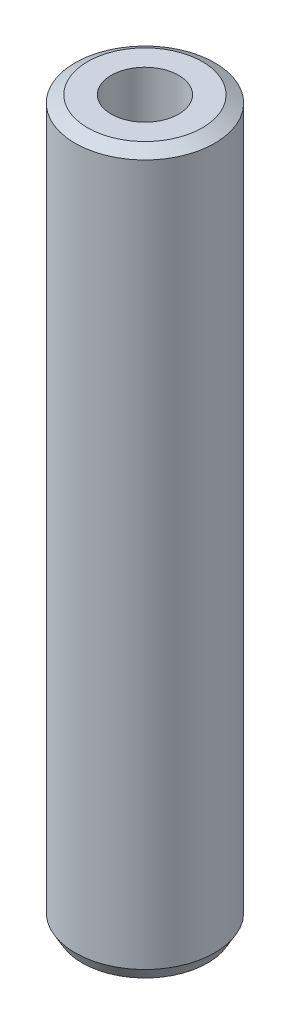
ISO-10303-21;
HEADER;
FILE_DESCRIPTION(('STEP AP214'),'2;1');
FILE_NAME('part.step','',(''),(''),'','','');
FILE_SCHEMA(('AUTOMOTIVE_DESIGN { 1 0 10303 214 1 1 1 1 }'));
ENDSEC;
DATA;
#1=APPLICATION_CONTEXT('core data for automotive mechanical design processes');
#2=APPLICATION_PROTOCOL_DEFINITION('international standard','automotive_design',2000,#1);
#3=PRODUCT_CONTEXT('',#1,'mechanical');
#4=PRODUCT('Part','Part','',(#3));
#5=PRODUCT_RELATED_PRODUCT_CATEGORY('part','',(#4));
#6=PRODUCT_DEFINITION_FORMATION('','',#4);
#7=PRODUCT_DEFINITION_CONTEXT('part definition',#1,'design');
#8=PRODUCT_DEFINITION('design','',#6,#7);
#9=PRODUCT_DEFINITION_SHAPE('','',#8);
#10=(LENGTH_UNIT() NAMED_UNIT(*) SI_UNIT(.MILLI.,.METRE.));
#11=(NAMED_UNIT(*) PLANE_ANGLE_UNIT() SI_UNIT($,.RADIAN.));
#12=(NAMED_UNIT(*) SI_UNIT($,.STERADIAN.) SOLID_ANGLE_UNIT());
#13=UNCERTAINTY_MEASURE_WITH_UNIT(LENGTH_MEASURE(1.E-05),#10,'distance_accuracy_value','');
#14=(GEOMETRIC_REPRESENTATION_CONTEXT(3) GLOBAL_UNCERTAINTY_ASSIGNED_CONTEXT((#13)) GLOBAL_UNIT_ASSIGNED_CONTEXT((#10,
#11,#12)) REPRESENTATION_CONTEXT('',''));
#15=CARTESIAN_POINT('',(0.,0.,0.));
#16=DIRECTION('',(0.,0.,1.));
#17=DIRECTION('',(1.,0.,0.));
#18=AXIS2_PLACEMENT_3D('',#15,#16,#17);
#19=CARTESIAN_POINT('',(0.,361.280145548675,0.));
#20=DIRECTION('',(0.,-1.,0.));
#21=DIRECTION('',(0.,0.,-1.));
#22=AXIS2_PLACEMENT_3D('',#19,#20,#21);
#23=CYLINDRICAL_SURFACE('',#22,35.);
#24=CARTESIAN_POINT('',(0.,357.680880590459,0.));
#25=DIRECTION('',(0.,1.,0.));
#26=DIRECTION('',(0.,0.,1.));
#27=AXIS2_PLACEMENT_3D('',#24,#25,#26);
#28=CIRCLE('',#27,35.);
#29=CARTESIAN_POINT('',(0.,357.680880590459,35.));
#30=VERTEX_POINT('',#29);
#31=EDGE_CURVE('E50',#30,#30,#28,.F.);
#32=ORIENTED_EDGE('',*,*,#31,.T.);
#33=EDGE_LOOP('',(#32));
#34=FACE_BOUND('',#33,.T.);
#35=CARTESIAN_POINT('',(0.,6.23410977753264,0.));
#36=DIRECTION('',(0.,1.,0.));
#37=DIRECTION('',(0.,0.,1.));
#38=AXIS2_PLACEMENT_3D('',#35,#36,#37);
#39=CIRCLE('',#38,35.);
#40=CARTESIAN_POINT('',(0.,6.23410977753264,35.));
#41=VERTEX_POINT('',#40);
#42=EDGE_CURVE('E51',#41,#41,#39,.T.);
#43=ORIENTED_EDGE('',*,*,#42,.T.);
#44=EDGE_LOOP('',(#43));
#45=FACE_BOUND('',#44,.T.);
#46=ADVANCED_FACE('F39',(#34,#45),#23,.T.);
#47=CARTESIAN_POINT('',(0.,361.280145548675,0.));
#48=DIRECTION('',(0.,1.,0.));
#49=DIRECTION('',(0.,0.,1.));
#50=AXIS2_PLACEMENT_3D('',#47,#48,#49);
#51=PLANE('',#50);
#52=CARTESIAN_POINT('',(0.,361.280145548675,0.));
#53=DIRECTION('',(0.,1.,0.));
#54=DIRECTION('',(0.,0.,1.));
#55=AXIS2_PLACEMENT_3D('',#52,#53,#54);
#56=CIRCLE('',#55,28.7658902224671);
#57=CARTESIAN_POINT('',(0.,361.280145548675,28.7658902224671));
#58=VERTEX_POINT('',#57);
#59=EDGE_CURVE('E54',#58,#58,#56,.T.);
#60=ORIENTED_EDGE('',*,*,#59,.T.);
#61=EDGE_LOOP('',(#60));
#62=FACE_BOUND('',#61,.T.);
#63=CARTESIAN_POINT('',(0.,361.280145548675,0.));
#64=DIRECTION('',(0.,1.,0.));
#65=DIRECTION('',(0.,0.,1.));
#66=AXIS2_PLACEMENT_3D('',#63,#64,#65);
#67=CIRCLE('',#66,16.8919277344593);
#68=CARTESIAN_POINT('',(0.,361.280145548675,16.8919277344593));
#69=VERTEX_POINT('',#68);
#70=EDGE_CURVE('E58',#69,#69,#67,.T.);
#71=ORIENTED_EDGE('',*,*,#70,.F.);
#72=EDGE_LOOP('',(#71));
#73=FACE_BOUND('',#72,.T.);
#74=ADVANCED_FACE('F69',(#62,#73),#51,.T.);
#75=CARTESIAN_POINT('',(0.,0.,0.));
#76=DIRECTION('',(0.,1.,0.));
#77=DIRECTION('',(0.,0.,1.));
#78=AXIS2_PLACEMENT_3D('',#75,#76,#77);
#79=PLANE('',#78);
#80=CARTESIAN_POINT('',(0.,0.,0.));
#81=DIRECTION('',(0.,1.,0.));
#82=DIRECTION('',(0.,0.,1.));
#83=AXIS2_PLACEMENT_3D('',#80,#81,#82);
#84=CIRCLE('',#83,31.4007350417838);
#85=CARTESIAN_POINT('',(0.,0.,31.4007350417838));
#86=VERTEX_POINT('',#85);
#87=EDGE_CURVE('E10',#86,#86,#84,.F.);
#88=ORIENTED_EDGE('',*,*,#87,.T.);
#89=EDGE_LOOP('',(#88));
#90=FACE_BOUND('',#89,.T.);
#91=CARTESIAN_POINT('',(0.,0.,0.));
#92=DIRECTION('',(0.,1.,0.));
#93=DIRECTION('',(0.,0.,1.));
#94=AXIS2_PLACEMENT_3D('',#91,#92,#93);
#95=CIRCLE('',#94,16.8919277344593);
#96=CARTESIAN_POINT('',(0.,0.,16.8919277344593));
#97=VERTEX_POINT('',#96);
#98=EDGE_CURVE('E63',#97,#97,#95,.T.);
#99=ORIENTED_EDGE('',*,*,#98,.T.);
#100=EDGE_LOOP('',(#99));
#101=FACE_BOUND('',#100,.T.);
#102=ADVANCED_FACE('F75',(#90,#101),#79,.F.);
#103=CARTESIAN_POINT('',(0.,361.280145548675,0.));
#104=DIRECTION('',(0.,-1.,0.));
#105=DIRECTION('',(0.,0.,-1.));
#106=AXIS2_PLACEMENT_3D('',#103,#104,#105);
#107=CYLINDRICAL_SURFACE('',#106,16.8919277344593);
#108=ORIENTED_EDGE('',*,*,#70,.T.);
#109=EDGE_LOOP('',(#108));
#110=FACE_BOUND('',#109,.T.);
#111=ORIENTED_EDGE('',*,*,#98,.F.);
#112=EDGE_LOOP('',(#111));
#113=FACE_BOUND('',#112,.T.);
#114=ADVANCED_FACE('F70',(#110,#113),#107,.F.);
#115=CARTESIAN_POINT('',(0.,361.280145548675,0.));
#116=DIRECTION('',(0.,-1.,0.));
#117=DIRECTION('',(0.,0.,-1.));
#118=AXIS2_PLACEMENT_3D('',#115,#116,#117);
#119=CONICAL_SURFACE('',#118,28.7658902224671,1.04719755119659);
#120=ORIENTED_EDGE('',*,*,#31,.F.);
#121=EDGE_LOOP('',(#120));
#122=FACE_BOUND('',#121,.T.);
#123=ORIENTED_EDGE('',*,*,#59,.F.);
#124=EDGE_LOOP('',(#123));
#125=FACE_BOUND('',#124,.T.);
#126=ADVANCED_FACE('F81',(#122,#125),#119,.T.);
#127=CARTESIAN_POINT('',(0.,6.23410977753264,0.));
#128=DIRECTION('',(0.,1.,0.));
#129=DIRECTION('',(0.,0.,1.));
#130=AXIS2_PLACEMENT_3D('',#127,#128,#129);
#131=CONICAL_SURFACE('',#130,35.,0.523598775598302);
#132=CARTESIAN_POINT('',(0.,0.,31.4007350417838));
#133=CARTESIAN_POINT('',(0.,0.0649386435159641,31.4382273850986));
#134=CARTESIAN_POINT('',(0.,0.129877287031929,31.4757197284133));
#135=CARTESIAN_POINT('',(0.,0.259754574063859,31.5507044150428));
#136=CARTESIAN_POINT('',(0.,0.324693217579824,31.5881967583576));
#137=CARTESIAN_POINT('',(0.,0.454570504611754,31.6631814449871));
#138=CARTESIAN_POINT('',(0.,0.519509148127719,31.7006737883019));
#139=CARTESIAN_POINT('',(0.,0.649386435159649,31.7756584749314));
#140=CARTESIAN_POINT('',(0.,0.714325078675614,31.8131508182461));
#141=CARTESIAN_POINT('',(0.,0.844202365707544,31.8881355048756));
#142=CARTESIAN_POINT('',(0.,0.909141009223509,31.9256278481904));
#143=CARTESIAN_POINT('',(0.,1.03901829625544,32.0006125348199));
#144=CARTESIAN_POINT('',(0.,1.1039569397714,32.0381048781346));
#145=CARTESIAN_POINT('',(0.,1.23383422680333,32.1130895647641));
#146=CARTESIAN_POINT('',(0.,1.2987728703193,32.1505819080789));
#147=CARTESIAN_POINT('',(0.,1.42865015735123,32.2255665947084));
#148=CARTESIAN_POINT('',(0.,1.49358880086719,32.2630589380231));
#149=CARTESIAN_POINT('',(0.,1.62346608789912,32.3380436246526));
#150=CARTESIAN_POINT('',(0.,1.68840473141509,32.3755359679674));
#151=CARTESIAN_POINT('',(0.,1.81828201844702,32.4505206545969));
#152=CARTESIAN_POINT('',(0.,1.88322066196298,32.4880129979116));
#153=CARTESIAN_POINT('',(0.,2.01309794899491,32.5629976845411));
#154=CARTESIAN_POINT('',(0.,2.07803659251088,32.6004900278559));
#155=CARTESIAN_POINT('',(0.,2.20791387954281,32.6754747144854));
#156=CARTESIAN_POINT('',(0.,2.27285252305877,32.7129670578001));
#157=CARTESIAN_POINT('',(0.,2.4027298100907,32.7879517444297));
#158=CARTESIAN_POINT('',(0.,2.46766845360667,32.8254440877444));
#159=CARTESIAN_POINT('',(0.,2.5975457406386,32.9004287743739));
#160=CARTESIAN_POINT('',(0.,2.66248438415456,32.9379211176887));
#161=CARTESIAN_POINT('',(0.,2.79236167118649,33.0129058043182));
#162=CARTESIAN_POINT('',(0.,2.85730031470246,33.0503981476329));
#163=CARTESIAN_POINT('',(0.,2.98717760173439,33.1253828342624));
#164=CARTESIAN_POINT('',(0.,3.05211624525035,33.1628751775772));
#165=CARTESIAN_POINT('',(0.,3.18199353228228,33.2378598642067));
#166=CARTESIAN_POINT('',(0.,3.24693217579825,33.2753522075214));
#167=CARTESIAN_POINT('',(0.,3.37680946283018,33.3503368941509));
#168=CARTESIAN_POINT('',(0.,3.44174810634614,33.3878292374657));
#169=CARTESIAN_POINT('',(0.,3.57162539337807,33.4628139240952));
#170=CARTESIAN_POINT('',(0.,3.63656403689404,33.5003062674099));
#171=CARTESIAN_POINT('',(0.,3.76644132392597,33.5752909540394));
#172=CARTESIAN_POINT('',(0.,3.83137996744193,33.6127832973542));
#173=CARTESIAN_POINT('',(0.,3.96125725447386,33.6877679839837));
#174=CARTESIAN_POINT('',(0.,4.02619589798983,33.7252603272985));
#175=CARTESIAN_POINT('',(0.,4.15607318502176,33.800245013928));
#176=CARTESIAN_POINT('',(0.,4.22101182853772,33.8377373572427));
#177=CARTESIAN_POINT('',(0.,4.35088911556965,33.9127220438722));
#178=CARTESIAN_POINT('',(0.,4.41582775908562,33.950214387187));
#179=CARTESIAN_POINT('',(0.,4.54570504611755,34.0251990738165));
#180=CARTESIAN_POINT('',(0.,4.61064368963351,34.0626914171312));
#181=CARTESIAN_POINT('',(0.,4.74052097666544,34.1376761037607));
#182=CARTESIAN_POINT('',(0.,4.80545962018141,34.1751684470755));
#183=CARTESIAN_POINT('',(0.,4.93533690721334,34.250153133705));
#184=CARTESIAN_POINT('',(0.,5.0002755507293,34.2876454770197));
#185=CARTESIAN_POINT('',(0.,5.13015283776123,34.3626301636492));
#186=CARTESIAN_POINT('',(0.,5.1950914812772,34.400122506964));
#187=CARTESIAN_POINT('',(0.,5.32496876830913,34.4751071935935));
#188=CARTESIAN_POINT('',(0.,5.38990741182509,34.5125995369082));
#189=CARTESIAN_POINT('',(0.,5.51978469885702,34.5875842235377));
#190=CARTESIAN_POINT('',(0.,5.58472334237299,34.6250765668525));
#191=CARTESIAN_POINT('',(0.,5.71460062940492,34.700061253482));
#192=CARTESIAN_POINT('',(0.,5.77953927292088,34.7375535967968));
#193=CARTESIAN_POINT('',(0.,5.90941655995281,34.8125382834262));
#194=CARTESIAN_POINT('',(0.,5.97435520346878,34.850030626741));
#195=CARTESIAN_POINT('',(0.,6.10423249050071,34.9250153133705));
#196=CARTESIAN_POINT('',(0.,6.16917113401667,34.9625076566853));
#197=CARTESIAN_POINT('',(0.,6.23410977753264,35.));
#198=B_SPLINE_CURVE_WITH_KNOTS('',3,(#132,#133,#134,#135,#136,#137,#138,#139,#140,#141,#142,
#143,#144,#145,#146,#147,#148,#149,#150,#151,#152,#153,#154,#155,#156,#157,#158,#159,#160,#161,
#162,#163,#164,#165,#166,#167,#168,#169,#170,#171,#172,#173,#174,#175,#176,#177,#178,#179,#180,
#181,#182,#183,#184,#185,#186,#187,#188,#189,#190,#191,#192,#193,#194,#195,#196,#197),
.UNSPECIFIED.,.F.,.F.,(4,2,2,2,2,2,2,2,2,2,2,2,2,2,2,2,2,2,2,2,2,2,2,2,2,2,2,2,2,2,2,2,4),(0.,
0.224954059888509,0.449908119777019,0.674862179665528,0.899816239554038,1.12477029944255,
1.34972435933106,1.57467841921957,1.79963247910808,2.02458653899658,2.24954059888509,
2.4744946587736,2.69944871866211,2.92440277855062,3.14935683843913,3.37431089832764,
3.59926495821615,3.82421901810466,4.04917307799317,4.27412713788168,4.49908119777019,
4.7240352576587,4.94898931754721,5.17394337743572,5.39889743732423,5.62385149721274,
5.84880555710125,6.07375961698976,6.29871367687827,6.52366773676678,6.74862179665529,
6.9735758565438,7.1985299164323),.UNSPECIFIED.);
#199=EDGE_CURVE('BSEAM45',#86,#41,#198,.T.);
#200=ORIENTED_EDGE('',*,*,#87,.F.);
#201=ORIENTED_EDGE('',*,*,#42,.F.);
#202=ORIENTED_EDGE('',*,*,#199,.T.);
#203=ORIENTED_EDGE('',*,*,#199,.F.);
#204=EDGE_LOOP('',(#200,#202,#201,#203));
#205=FACE_BOUND('',#204,.T.);
#206=ADVANCED_FACE('F45',(#205),#131,.T.);
#207=CLOSED_SHELL('',(#46,#74,#102,#114,#126,#206));
#208=MANIFOLD_SOLID_BREP('B2',#207);
#209=ADVANCED_BREP_SHAPE_REPRESENTATION('',(#18,#208),#14);
#210=SHAPE_DEFINITION_REPRESENTATION(#9,#209);
ENDSEC;
END-ISO-10303-21;
